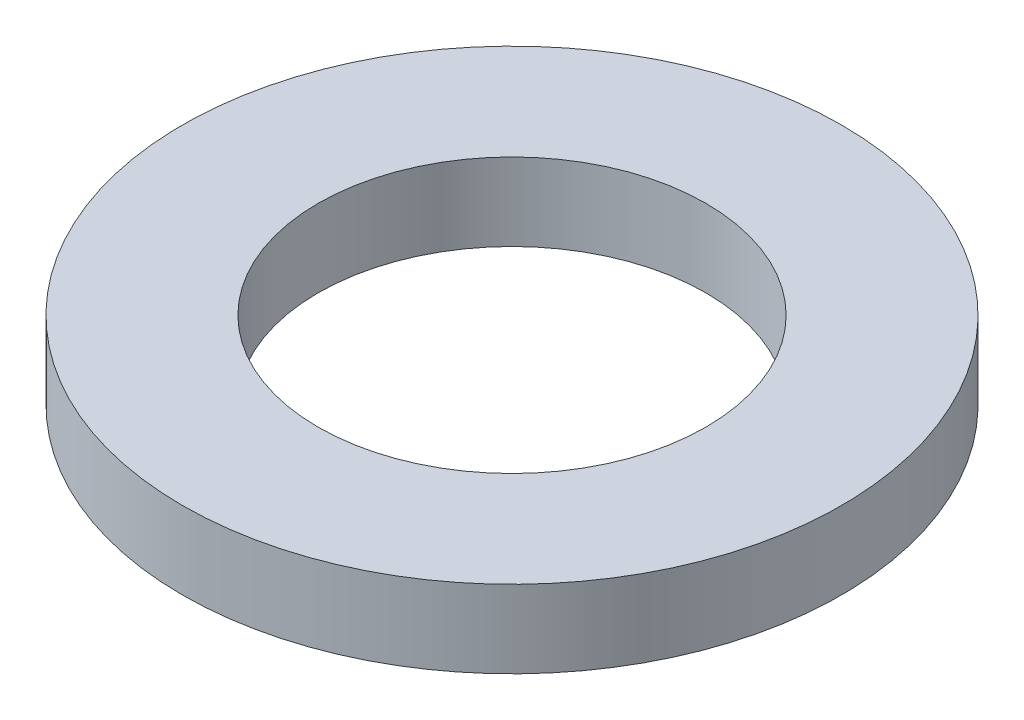
ISO-10303-21;
HEADER;
FILE_DESCRIPTION(('STEP AP214'),'2;1');
FILE_NAME('part.step','',(''),(''),'','','');
FILE_SCHEMA(('AUTOMOTIVE_DESIGN { 1 0 10303 214 1 1 1 1 }'));
ENDSEC;
DATA;
#1=APPLICATION_CONTEXT('core data for automotive mechanical design processes');
#2=APPLICATION_PROTOCOL_DEFINITION('international standard','automotive_design',2000,#1);
#3=PRODUCT_CONTEXT('',#1,'mechanical');
#4=PRODUCT('Part','Part','',(#3));
#5=PRODUCT_RELATED_PRODUCT_CATEGORY('part','',(#4));
#6=PRODUCT_DEFINITION_FORMATION('','',#4);
#7=PRODUCT_DEFINITION_CONTEXT('part definition',#1,'design');
#8=PRODUCT_DEFINITION('design','',#6,#7);
#9=PRODUCT_DEFINITION_SHAPE('','',#8);
#10=(LENGTH_UNIT() NAMED_UNIT(*) SI_UNIT(.MILLI.,.METRE.));
#11=(NAMED_UNIT(*) PLANE_ANGLE_UNIT() SI_UNIT($,.RADIAN.));
#12=(NAMED_UNIT(*) SI_UNIT($,.STERADIAN.) SOLID_ANGLE_UNIT());
#13=UNCERTAINTY_MEASURE_WITH_UNIT(LENGTH_MEASURE(1.E-05),#10,'distance_accuracy_value','');
#14=(GEOMETRIC_REPRESENTATION_CONTEXT(3) GLOBAL_UNCERTAINTY_ASSIGNED_CONTEXT((#13)) GLOBAL_UNIT_ASSIGNED_CONTEXT((#10,
#11,#12)) REPRESENTATION_CONTEXT('',''));
#15=CARTESIAN_POINT('',(0.,0.,0.));
#16=DIRECTION('',(0.,0.,1.));
#17=DIRECTION('',(1.,0.,0.));
#18=AXIS2_PLACEMENT_3D('',#15,#16,#17);
#19=CARTESIAN_POINT('',(0.,20.,0.));
#20=DIRECTION('',(0.,-1.,0.));
#21=DIRECTION('',(0.,0.,-1.));
#22=AXIS2_PLACEMENT_3D('',#19,#20,#21);
#23=CYLINDRICAL_SURFACE('',#22,85.);
#24=CARTESIAN_POINT('',(0.,20.,0.));
#25=DIRECTION('',(0.,1.,0.));
#26=DIRECTION('',(0.,0.,1.));
#27=AXIS2_PLACEMENT_3D('',#24,#25,#26);
#28=CIRCLE('',#27,85.);
#29=CARTESIAN_POINT('',(0.,20.,85.));
#30=VERTEX_POINT('',#29);
#31=EDGE_CURVE('E10',#30,#30,#28,.T.);
#32=ORIENTED_EDGE('',*,*,#31,.F.);
#33=EDGE_LOOP('',(#32));
#34=FACE_BOUND('',#33,.T.);
#35=CARTESIAN_POINT('',(0.,0.,0.));
#36=DIRECTION('',(0.,1.,0.));
#37=DIRECTION('',(0.,0.,1.));
#38=AXIS2_PLACEMENT_3D('',#35,#36,#37);
#39=CIRCLE('',#38,85.);
#40=CARTESIAN_POINT('',(0.,0.,85.));
#41=VERTEX_POINT('',#40);
#42=EDGE_CURVE('E37',#41,#41,#39,.T.);
#43=ORIENTED_EDGE('',*,*,#42,.T.);
#44=EDGE_LOOP('',(#43));
#45=FACE_BOUND('',#44,.T.);
#46=ADVANCED_FACE('F40',(#34,#45),#23,.T.);
#47=CARTESIAN_POINT('',(0.,20.,0.));
#48=DIRECTION('',(0.,1.,0.));
#49=DIRECTION('',(0.,0.,1.));
#50=AXIS2_PLACEMENT_3D('',#47,#48,#49);
#51=PLANE('',#50);
#52=CARTESIAN_POINT('',(0.,20.,0.));
#53=DIRECTION('',(0.,1.,0.));
#54=DIRECTION('',(0.,0.,1.));
#55=AXIS2_PLACEMENT_3D('',#52,#53,#54);
#56=CIRCLE('',#55,50.);
#57=CARTESIAN_POINT('',(0.,20.,50.));
#58=VERTEX_POINT('',#57);
#59=EDGE_CURVE('E50',#58,#58,#56,.T.);
#60=ORIENTED_EDGE('',*,*,#59,.F.);
#61=EDGE_LOOP('',(#60));
#62=FACE_BOUND('',#61,.T.);
#63=ORIENTED_EDGE('',*,*,#31,.T.);
#64=EDGE_LOOP('',(#63));
#65=FACE_BOUND('',#64,.T.);
#66=ADVANCED_FACE('F59',(#62,#65),#51,.T.);
#67=CARTESIAN_POINT('',(0.,0.,0.));
#68=DIRECTION('',(0.,1.,0.));
#69=DIRECTION('',(0.,0.,1.));
#70=AXIS2_PLACEMENT_3D('',#67,#68,#69);
#71=PLANE('',#70);
#72=CARTESIAN_POINT('',(0.,0.,0.));
#73=DIRECTION('',(0.,1.,0.));
#74=DIRECTION('',(0.,0.,1.));
#75=AXIS2_PLACEMENT_3D('',#72,#73,#74);
#76=CIRCLE('',#75,50.);
#77=CARTESIAN_POINT('',(0.,0.,50.));
#78=VERTEX_POINT('',#77);
#79=EDGE_CURVE('E47',#78,#78,#76,.T.);
#80=ORIENTED_EDGE('',*,*,#79,.T.);
#81=EDGE_LOOP('',(#80));
#82=FACE_BOUND('',#81,.T.);
#83=ORIENTED_EDGE('',*,*,#42,.F.);
#84=EDGE_LOOP('',(#83));
#85=FACE_BOUND('',#84,.T.);
#86=ADVANCED_FACE('F58',(#82,#85),#71,.F.);
#87=CARTESIAN_POINT('',(0.,20.,0.));
#88=DIRECTION('',(0.,-1.,0.));
#89=DIRECTION('',(0.,0.,-1.));
#90=AXIS2_PLACEMENT_3D('',#87,#88,#89);
#91=CYLINDRICAL_SURFACE('',#90,50.);
#92=ORIENTED_EDGE('',*,*,#59,.T.);
#93=EDGE_LOOP('',(#92));
#94=FACE_BOUND('',#93,.T.);
#95=ORIENTED_EDGE('',*,*,#79,.F.);
#96=EDGE_LOOP('',(#95));
#97=FACE_BOUND('',#96,.T.);
#98=ADVANCED_FACE('F54',(#94,#97),#91,.F.);
#99=CLOSED_SHELL('',(#46,#66,#86,#98));
#100=MANIFOLD_SOLID_BREP('B2',#99);
#101=ADVANCED_BREP_SHAPE_REPRESENTATION('',(#18,#100),#14);
#102=SHAPE_DEFINITION_REPRESENTATION(#9,#101);
ENDSEC;
END-ISO-10303-21;
